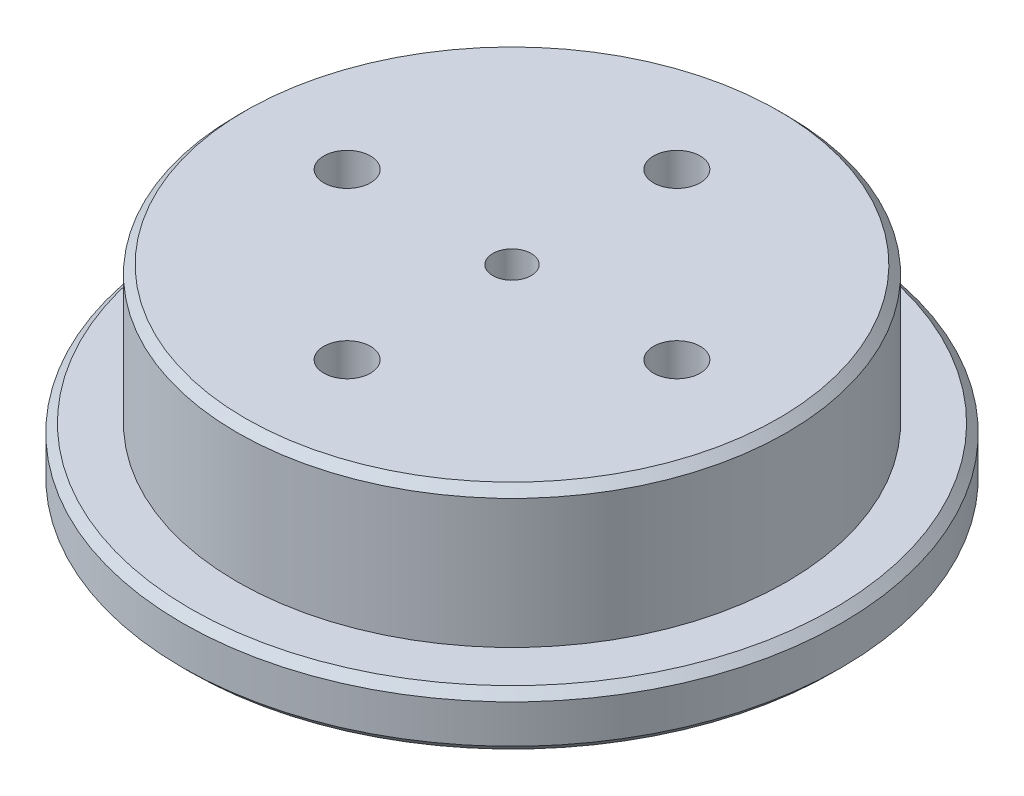
ISO-10303-21;
HEADER;
FILE_DESCRIPTION(('STEP AP214'),'2;1');
FILE_NAME('part.step','',(''),(''),'','','');
FILE_SCHEMA(('AUTOMOTIVE_DESIGN { 1 0 10303 214 1 1 1 1 }'));
ENDSEC;
DATA;
#1=APPLICATION_CONTEXT('core data for automotive mechanical design processes');
#2=APPLICATION_PROTOCOL_DEFINITION('international standard','automotive_design',2000,#1);
#3=PRODUCT_CONTEXT('',#1,'mechanical');
#4=PRODUCT('Part','Part','',(#3));
#5=PRODUCT_RELATED_PRODUCT_CATEGORY('part','',(#4));
#6=PRODUCT_DEFINITION_FORMATION('','',#4);
#7=PRODUCT_DEFINITION_CONTEXT('part definition',#1,'design');
#8=PRODUCT_DEFINITION('design','',#6,#7);
#9=PRODUCT_DEFINITION_SHAPE('','',#8);
#10=(LENGTH_UNIT() NAMED_UNIT(*) SI_UNIT(.MILLI.,.METRE.));
#11=(NAMED_UNIT(*) PLANE_ANGLE_UNIT() SI_UNIT($,.RADIAN.));
#12=(NAMED_UNIT(*) SI_UNIT($,.STERADIAN.) SOLID_ANGLE_UNIT());
#13=UNCERTAINTY_MEASURE_WITH_UNIT(LENGTH_MEASURE(1.E-05),#10,'distance_accuracy_value','');
#14=(GEOMETRIC_REPRESENTATION_CONTEXT(3) GLOBAL_UNCERTAINTY_ASSIGNED_CONTEXT((#13)) GLOBAL_UNIT_ASSIGNED_CONTEXT((#10,
#11,#12)) REPRESENTATION_CONTEXT('',''));
#15=CARTESIAN_POINT('',(0.,0.,0.));
#16=DIRECTION('',(0.,0.,1.));
#17=DIRECTION('',(1.,0.,0.));
#18=AXIS2_PLACEMENT_3D('',#15,#16,#17);
#19=CARTESIAN_POINT('',(0.,20.,0.));
#20=DIRECTION('',(0.,-1.,0.));
#21=DIRECTION('',(0.,0.,-1.));
#22=AXIS2_PLACEMENT_3D('',#19,#20,#21);
#23=CYLINDRICAL_SURFACE('',#22,120.);
#24=CARTESIAN_POINT('',(0.,2.99999999999999,0.));
#25=DIRECTION('',(0.,1.,0.));
#26=DIRECTION('',(0.,0.,1.));
#27=AXIS2_PLACEMENT_3D('',#24,#25,#26);
#28=CIRCLE('',#27,120.);
#29=CARTESIAN_POINT('',(0.,2.99999999999999,120.));
#30=VERTEX_POINT('',#29);
#31=EDGE_CURVE('E112',#30,#30,#28,.T.);
#32=ORIENTED_EDGE('',*,*,#31,.T.);
#33=EDGE_LOOP('',(#32));
#34=FACE_BOUND('',#33,.T.);
#35=CARTESIAN_POINT('',(0.,17.0000000000001,0.));
#36=DIRECTION('',(0.,1.,0.));
#37=DIRECTION('',(0.,0.,1.));
#38=AXIS2_PLACEMENT_3D('',#35,#36,#37);
#39=CIRCLE('',#38,120.);
#40=CARTESIAN_POINT('',(0.,17.0000000000001,120.));
#41=VERTEX_POINT('',#40);
#42=EDGE_CURVE('E109',#41,#41,#39,.F.);
#43=ORIENTED_EDGE('',*,*,#42,.T.);
#44=EDGE_LOOP('',(#43));
#45=FACE_BOUND('',#44,.T.);
#46=ADVANCED_FACE('F53',(#34,#45),#23,.T.);
#47=CARTESIAN_POINT('',(0.,20.,0.));
#48=DIRECTION('',(0.,1.,0.));
#49=DIRECTION('',(0.,0.,1.));
#50=AXIS2_PLACEMENT_3D('',#47,#48,#49);
#51=PLANE('',#50);
#52=CARTESIAN_POINT('',(0.,20.,0.));
#53=DIRECTION('',(0.,1.,0.));
#54=DIRECTION('',(0.,0.,1.));
#55=AXIS2_PLACEMENT_3D('',#52,#53,#54);
#56=CIRCLE('',#55,117.);
#57=CARTESIAN_POINT('',(0.,20.,117.));
#58=VERTEX_POINT('',#57);
#59=EDGE_CURVE('E118',#58,#58,#56,.T.);
#60=ORIENTED_EDGE('',*,*,#59,.T.);
#61=EDGE_LOOP('',(#60));
#62=FACE_BOUND('',#61,.T.);
#63=CARTESIAN_POINT('',(0.,20.,0.));
#64=DIRECTION('',(0.,1.,0.));
#65=DIRECTION('',(0.,0.,1.));
#66=AXIS2_PLACEMENT_3D('',#63,#64,#65);
#67=CIRCLE('',#66,100.);
#68=CARTESIAN_POINT('',(0.,20.,100.));
#69=VERTEX_POINT('',#68);
#70=EDGE_CURVE('E103',#69,#69,#67,.T.);
#71=ORIENTED_EDGE('',*,*,#70,.F.);
#72=EDGE_LOOP('',(#71));
#73=FACE_BOUND('',#72,.T.);
#74=ADVANCED_FACE('F141',(#62,#73),#51,.T.);
#75=CARTESIAN_POINT('',(0.,0.,0.));
#76=DIRECTION('',(0.,1.,0.));
#77=DIRECTION('',(0.,0.,1.));
#78=AXIS2_PLACEMENT_3D('',#75,#76,#77);
#79=PLANE('',#78);
#80=CARTESIAN_POINT('',(0.,0.,0.));
#81=DIRECTION('',(0.,1.,0.));
#82=DIRECTION('',(0.,0.,1.));
#83=AXIS2_PLACEMENT_3D('',#80,#81,#82);
#84=CIRCLE('',#83,117.);
#85=CARTESIAN_POINT('',(0.,0.,117.));
#86=VERTEX_POINT('',#85);
#87=EDGE_CURVE('E115',#86,#86,#84,.F.);
#88=ORIENTED_EDGE('',*,*,#87,.T.);
#89=EDGE_LOOP('',(#88));
#90=FACE_BOUND('',#89,.T.);
#91=CARTESIAN_POINT('',(0.,0.,0.));
#92=DIRECTION('',(0.,1.,0.));
#93=DIRECTION('',(0.,0.,1.));
#94=AXIS2_PLACEMENT_3D('',#91,#92,#93);
#95=CIRCLE('',#94,20.);
#96=CARTESIAN_POINT('',(0.,0.,20.));
#97=VERTEX_POINT('',#96);
#98=EDGE_CURVE('E106',#97,#97,#95,.F.);
#99=ORIENTED_EDGE('',*,*,#98,.F.);
#100=EDGE_LOOP('',(#99));
#101=FACE_BOUND('',#100,.T.);
#102=CARTESIAN_POINT('',(0.,0.,-60.));
#103=DIRECTION('',(0.,1.,0.));
#104=DIRECTION('',(0.,0.,1.));
#105=AXIS2_PLACEMENT_3D('',#102,#103,#104);
#106=CIRCLE('',#105,8.5);
#107=CARTESIAN_POINT('',(0.,0.,-51.5));
#108=VERTEX_POINT('',#107);
#109=EDGE_CURVE('E100',#108,#108,#106,.T.);
#110=ORIENTED_EDGE('',*,*,#109,.T.);
#111=EDGE_LOOP('',(#110));
#112=FACE_BOUND('',#111,.T.);
#113=CARTESIAN_POINT('',(60.,0.,2.09488880330588E-13));
#114=DIRECTION('',(0.,1.,0.));
#115=DIRECTION('',(0.,0.,1.));
#116=AXIS2_PLACEMENT_3D('',#113,#114,#115);
#117=CIRCLE('',#116,8.5);
#118=CARTESIAN_POINT('',(60.,0.,8.50000000000021));
#119=VERTEX_POINT('',#118);
#120=EDGE_CURVE('E97',#119,#119,#117,.T.);
#121=ORIENTED_EDGE('',*,*,#120,.T.);
#122=EDGE_LOOP('',(#121));
#123=FACE_BOUND('',#122,.T.);
#124=CARTESIAN_POINT('',(-4.18977760661176E-13,0.,60.));
#125=DIRECTION('',(0.,1.,0.));
#126=DIRECTION('',(0.,0.,1.));
#127=AXIS2_PLACEMENT_3D('',#124,#125,#126);
#128=CIRCLE('',#127,8.5);
#129=CARTESIAN_POINT('',(-4.18977760661176E-13,0.,68.5));
#130=VERTEX_POINT('',#129);
#131=EDGE_CURVE('E94',#130,#130,#128,.T.);
#132=ORIENTED_EDGE('',*,*,#131,.T.);
#133=EDGE_LOOP('',(#132));
#134=FACE_BOUND('',#133,.T.);
#135=CARTESIAN_POINT('',(-60.,0.,-6.28466640991764E-13));
#136=DIRECTION('',(0.,1.,0.));
#137=DIRECTION('',(0.,0.,1.));
#138=AXIS2_PLACEMENT_3D('',#135,#136,#137);
#139=CIRCLE('',#138,8.5);
#140=CARTESIAN_POINT('',(-60.,0.,8.49999999999937));
#141=VERTEX_POINT('',#140);
#142=EDGE_CURVE('E86',#141,#141,#139,.T.);
#143=ORIENTED_EDGE('',*,*,#142,.T.);
#144=EDGE_LOOP('',(#143));
#145=FACE_BOUND('',#144,.T.);
#146=ADVANCED_FACE('F148',(#90,#101,#112,#123,#134,#145),#79,.F.);
#147=CARTESIAN_POINT('',(0.,70.,0.));
#148=DIRECTION('',(0.,-1.,0.));
#149=DIRECTION('',(0.,0.,-1.));
#150=AXIS2_PLACEMENT_3D('',#147,#148,#149);
#151=CYLINDRICAL_SURFACE('',#150,100.);
#152=CARTESIAN_POINT('',(0.,67.,0.));
#153=DIRECTION('',(0.,1.,0.));
#154=DIRECTION('',(0.,0.,1.));
#155=AXIS2_PLACEMENT_3D('',#152,#153,#154);
#156=CIRCLE('',#155,100.);
#157=CARTESIAN_POINT('',(0.,67.,100.));
#158=VERTEX_POINT('',#157);
#159=EDGE_CURVE('E124',#158,#158,#156,.F.);
#160=ORIENTED_EDGE('',*,*,#159,.T.);
#161=EDGE_LOOP('',(#160));
#162=FACE_BOUND('',#161,.T.);
#163=ORIENTED_EDGE('',*,*,#70,.T.);
#164=EDGE_LOOP('',(#163));
#165=FACE_BOUND('',#164,.T.);
#166=ADVANCED_FACE('F179',(#162,#165),#151,.T.);
#167=CARTESIAN_POINT('',(0.,70.,0.));
#168=DIRECTION('',(0.,1.,0.));
#169=DIRECTION('',(0.,0.,1.));
#170=AXIS2_PLACEMENT_3D('',#167,#168,#169);
#171=PLANE('',#170);
#172=CARTESIAN_POINT('',(0.,70.,0.));
#173=DIRECTION('',(0.,1.,0.));
#174=DIRECTION('',(0.,0.,1.));
#175=AXIS2_PLACEMENT_3D('',#172,#173,#174);
#176=CIRCLE('',#175,97.);
#177=CARTESIAN_POINT('',(0.,70.,97.));
#178=VERTEX_POINT('',#177);
#179=EDGE_CURVE('E121',#178,#178,#176,.T.);
#180=ORIENTED_EDGE('',*,*,#179,.T.);
#181=EDGE_LOOP('',(#180));
#182=FACE_BOUND('',#181,.T.);
#183=CARTESIAN_POINT('',(0.,70.,0.));
#184=DIRECTION('',(0.,1.,0.));
#185=DIRECTION('',(0.,0.,1.));
#186=AXIS2_PLACEMENT_3D('',#183,#184,#185);
#187=CIRCLE('',#186,6.99999999999999);
#188=CARTESIAN_POINT('',(0.,70.,6.99999999999999));
#189=VERTEX_POINT('',#188);
#190=EDGE_CURVE('E75',#189,#189,#187,.T.);
#191=ORIENTED_EDGE('',*,*,#190,.F.);
#192=EDGE_LOOP('',(#191));
#193=FACE_BOUND('',#192,.T.);
#194=CARTESIAN_POINT('',(0.,70.,-60.));
#195=DIRECTION('',(0.,1.,0.));
#196=DIRECTION('',(0.,0.,1.));
#197=AXIS2_PLACEMENT_3D('',#194,#195,#196);
#198=CIRCLE('',#197,8.5);
#199=CARTESIAN_POINT('',(0.,70.,-51.5));
#200=VERTEX_POINT('',#199);
#201=EDGE_CURVE('E83',#200,#200,#198,.T.);
#202=ORIENTED_EDGE('',*,*,#201,.F.);
#203=EDGE_LOOP('',(#202));
#204=FACE_BOUND('',#203,.T.);
#205=CARTESIAN_POINT('',(60.,70.,2.09488880330588E-13));
#206=DIRECTION('',(0.,1.,0.));
#207=DIRECTION('',(0.,0.,1.));
#208=AXIS2_PLACEMENT_3D('',#205,#206,#207);
#209=CIRCLE('',#208,8.5);
#210=CARTESIAN_POINT('',(60.,70.,8.50000000000021));
#211=VERTEX_POINT('',#210);
#212=EDGE_CURVE('E87',#211,#211,#209,.T.);
#213=ORIENTED_EDGE('',*,*,#212,.F.);
#214=EDGE_LOOP('',(#213));
#215=FACE_BOUND('',#214,.T.);
#216=CARTESIAN_POINT('',(-4.18977760661176E-13,70.,60.));
#217=DIRECTION('',(0.,1.,0.));
#218=DIRECTION('',(0.,0.,1.));
#219=AXIS2_PLACEMENT_3D('',#216,#217,#218);
#220=CIRCLE('',#219,8.5);
#221=CARTESIAN_POINT('',(-4.18977760661176E-13,70.,68.5));
#222=VERTEX_POINT('',#221);
#223=EDGE_CURVE('E78',#222,#222,#220,.T.);
#224=ORIENTED_EDGE('',*,*,#223,.F.);
#225=EDGE_LOOP('',(#224));
#226=FACE_BOUND('',#225,.T.);
#227=CARTESIAN_POINT('',(-60.,70.,-6.28466640991764E-13));
#228=DIRECTION('',(0.,1.,0.));
#229=DIRECTION('',(0.,0.,1.));
#230=AXIS2_PLACEMENT_3D('',#227,#228,#229);
#231=CIRCLE('',#230,8.5);
#232=CARTESIAN_POINT('',(-60.,70.,8.49999999999937));
#233=VERTEX_POINT('',#232);
#234=EDGE_CURVE('E74',#233,#233,#231,.T.);
#235=ORIENTED_EDGE('',*,*,#234,.F.);
#236=EDGE_LOOP('',(#235));
#237=FACE_BOUND('',#236,.T.);
#238=ADVANCED_FACE('F181',(#182,#193,#204,#215,#226,#237),#171,.T.);
#239=CARTESIAN_POINT('',(-60.,-9.99999999999999,-6.28466640991764E-13));
#240=DIRECTION('',(0.,1.,0.));
#241=DIRECTION('',(0.,0.,1.));
#242=AXIS2_PLACEMENT_3D('',#239,#240,#241);
#243=CYLINDRICAL_SURFACE('',#242,8.5);
#244=ORIENTED_EDGE('',*,*,#234,.T.);
#245=EDGE_LOOP('',(#244));
#246=FACE_BOUND('',#245,.T.);
#247=ORIENTED_EDGE('',*,*,#142,.F.);
#248=EDGE_LOOP('',(#247));
#249=FACE_BOUND('',#248,.T.);
#250=ADVANCED_FACE('F188',(#246,#249),#243,.F.);
#251=CARTESIAN_POINT('',(-4.18977760661176E-13,-9.99999999999999,60.));
#252=DIRECTION('',(0.,1.,0.));
#253=DIRECTION('',(0.,0.,1.));
#254=AXIS2_PLACEMENT_3D('',#251,#252,#253);
#255=CYLINDRICAL_SURFACE('',#254,8.5);
#256=ORIENTED_EDGE('',*,*,#223,.T.);
#257=EDGE_LOOP('',(#256));
#258=FACE_BOUND('',#257,.T.);
#259=ORIENTED_EDGE('',*,*,#131,.F.);
#260=EDGE_LOOP('',(#259));
#261=FACE_BOUND('',#260,.T.);
#262=ADVANCED_FACE('F195',(#258,#261),#255,.F.);
#263=CARTESIAN_POINT('',(60.,-9.99999999999999,2.09488880330588E-13));
#264=DIRECTION('',(0.,1.,0.));
#265=DIRECTION('',(0.,0.,1.));
#266=AXIS2_PLACEMENT_3D('',#263,#264,#265);
#267=CYLINDRICAL_SURFACE('',#266,8.5);
#268=ORIENTED_EDGE('',*,*,#212,.T.);
#269=EDGE_LOOP('',(#268));
#270=FACE_BOUND('',#269,.T.);
#271=ORIENTED_EDGE('',*,*,#120,.F.);
#272=EDGE_LOOP('',(#271));
#273=FACE_BOUND('',#272,.T.);
#274=ADVANCED_FACE('F199',(#270,#273),#267,.F.);
#275=CARTESIAN_POINT('',(0.,-9.99999999999999,-60.));
#276=DIRECTION('',(0.,1.,0.));
#277=DIRECTION('',(0.,0.,1.));
#278=AXIS2_PLACEMENT_3D('',#275,#276,#277);
#279=CYLINDRICAL_SURFACE('',#278,8.5);
#280=ORIENTED_EDGE('',*,*,#201,.T.);
#281=EDGE_LOOP('',(#280));
#282=FACE_BOUND('',#281,.T.);
#283=ORIENTED_EDGE('',*,*,#109,.F.);
#284=EDGE_LOOP('',(#283));
#285=FACE_BOUND('',#284,.T.);
#286=ADVANCED_FACE('F203',(#282,#285),#279,.F.);
#287=CARTESIAN_POINT('',(0.,-20.,0.));
#288=DIRECTION('',(0.,1.,0.));
#289=DIRECTION('',(0.,0.,1.));
#290=AXIS2_PLACEMENT_3D('',#287,#288,#289);
#291=CYLINDRICAL_SURFACE('',#290,20.);
#292=CARTESIAN_POINT('',(0.,-16.9999999999999,0.));
#293=DIRECTION('',(0.,-1.,0.));
#294=DIRECTION('',(0.,0.,-1.));
#295=AXIS2_PLACEMENT_3D('',#292,#293,#294);
#296=CIRCLE('',#295,20.);
#297=CARTESIAN_POINT('',(0.,-16.9999999999999,-20.));
#298=VERTEX_POINT('',#297);
#299=EDGE_CURVE('E11',#298,#298,#296,.F.);
#300=ORIENTED_EDGE('',*,*,#299,.T.);
#301=EDGE_LOOP('',(#300));
#302=FACE_BOUND('',#301,.T.);
#303=ORIENTED_EDGE('',*,*,#98,.T.);
#304=EDGE_LOOP('',(#303));
#305=FACE_BOUND('',#304,.T.);
#306=ADVANCED_FACE('F207',(#302,#305),#291,.T.);
#307=CARTESIAN_POINT('',(0.,-20.,0.));
#308=DIRECTION('',(0.,-1.,0.));
#309=DIRECTION('',(0.,0.,-1.));
#310=AXIS2_PLACEMENT_3D('',#307,#308,#309);
#311=PLANE('',#310);
#312=CARTESIAN_POINT('',(0.,-20.,0.));
#313=DIRECTION('',(0.,-1.,0.));
#314=DIRECTION('',(0.,0.,-1.));
#315=AXIS2_PLACEMENT_3D('',#312,#313,#314);
#316=CIRCLE('',#315,17.);
#317=CARTESIAN_POINT('',(0.,-20.,-17.));
#318=VERTEX_POINT('',#317);
#319=EDGE_CURVE('E61',#318,#318,#316,.T.);
#320=ORIENTED_EDGE('',*,*,#319,.T.);
#321=EDGE_LOOP('',(#320));
#322=FACE_BOUND('',#321,.T.);
#323=ADVANCED_FACE('F68',(#322),#311,.T.);
#324=CARTESIAN_POINT('',(0.,50.,0.));
#325=DIRECTION('',(0.,1.,0.));
#326=DIRECTION('',(0.,0.,1.));
#327=AXIS2_PLACEMENT_3D('',#324,#325,#326);
#328=CONICAL_SURFACE('',#327,6.99999999999999,1.02974425867665);
#329=CARTESIAN_POINT('',(0.,45.7939756668071,0.));
#330=VERTEX_POINT('',#329);
#331=VERTEX_LOOP('',#330);
#332=FACE_BOUND('',#331,.T.);
#333=CARTESIAN_POINT('',(0.,50.,0.));
#334=DIRECTION('',(0.,1.,0.));
#335=DIRECTION('',(0.,0.,1.));
#336=AXIS2_PLACEMENT_3D('',#333,#334,#335);
#337=CIRCLE('',#336,6.99999999999999);
#338=CARTESIAN_POINT('',(0.,50.,6.99999999999999));
#339=VERTEX_POINT('',#338);
#340=EDGE_CURVE('E72',#339,#339,#337,.T.);
#341=ORIENTED_EDGE('',*,*,#340,.T.);
#342=EDGE_LOOP('',(#341));
#343=FACE_BOUND('',#342,.T.);
#344=ADVANCED_FACE('F64',(#332,#343),#328,.F.);
#345=CARTESIAN_POINT('',(0.,70.,0.));
#346=DIRECTION('',(0.,1.,0.));
#347=DIRECTION('',(0.,0.,1.));
#348=AXIS2_PLACEMENT_3D('',#345,#346,#347);
#349=CYLINDRICAL_SURFACE('',#348,6.99999999999999);
#350=ORIENTED_EDGE('',*,*,#340,.F.);
#351=EDGE_LOOP('',(#350));
#352=FACE_BOUND('',#351,.T.);
#353=ORIENTED_EDGE('',*,*,#190,.T.);
#354=EDGE_LOOP('',(#353));
#355=FACE_BOUND('',#354,.T.);
#356=ADVANCED_FACE('F67',(#352,#355),#349,.F.);
#357=CARTESIAN_POINT('',(0.,2.99999999999999,0.));
#358=DIRECTION('',(0.,1.,0.));
#359=DIRECTION('',(0.,0.,1.));
#360=AXIS2_PLACEMENT_3D('',#357,#358,#359);
#361=CONICAL_SURFACE('',#360,120.,0.785398163397448);
#362=ORIENTED_EDGE('',*,*,#87,.F.);
#363=EDGE_LOOP('',(#362));
#364=FACE_BOUND('',#363,.T.);
#365=ORIENTED_EDGE('',*,*,#31,.F.);
#366=EDGE_LOOP('',(#365));
#367=FACE_BOUND('',#366,.T.);
#368=ADVANCED_FACE('F155',(#364,#367),#361,.T.);
#369=CARTESIAN_POINT('',(0.,20.,0.));
#370=DIRECTION('',(0.,-1.,0.));
#371=DIRECTION('',(0.,0.,-1.));
#372=AXIS2_PLACEMENT_3D('',#369,#370,#371);
#373=CONICAL_SURFACE('',#372,117.,0.785398163397448);
#374=ORIENTED_EDGE('',*,*,#42,.F.);
#375=EDGE_LOOP('',(#374));
#376=FACE_BOUND('',#375,.T.);
#377=ORIENTED_EDGE('',*,*,#59,.F.);
#378=EDGE_LOOP('',(#377));
#379=FACE_BOUND('',#378,.T.);
#380=ADVANCED_FACE('F137',(#376,#379),#373,.T.);
#381=CARTESIAN_POINT('',(0.,70.,0.));
#382=DIRECTION('',(0.,-1.,0.));
#383=DIRECTION('',(0.,0.,-1.));
#384=AXIS2_PLACEMENT_3D('',#381,#382,#383);
#385=CONICAL_SURFACE('',#384,97.,0.785398163397437);
#386=ORIENTED_EDGE('',*,*,#159,.F.);
#387=EDGE_LOOP('',(#386));
#388=FACE_BOUND('',#387,.T.);
#389=ORIENTED_EDGE('',*,*,#179,.F.);
#390=EDGE_LOOP('',(#389));
#391=FACE_BOUND('',#390,.T.);
#392=ADVANCED_FACE('F131',(#388,#391),#385,.T.);
#393=CARTESIAN_POINT('',(0.,-20.,0.));
#394=DIRECTION('',(0.,1.,0.));
#395=DIRECTION('',(0.,0.,1.));
#396=AXIS2_PLACEMENT_3D('',#393,#394,#395);
#397=CONICAL_SURFACE('',#396,17.,0.785398163397446);
#398=ORIENTED_EDGE('',*,*,#299,.F.);
#399=EDGE_LOOP('',(#398));
#400=FACE_BOUND('',#399,.T.);
#401=ORIENTED_EDGE('',*,*,#319,.F.);
#402=EDGE_LOOP('',(#401));
#403=FACE_BOUND('',#402,.T.);
#404=ADVANCED_FACE('F56',(#400,#403),#397,.T.);
#405=CLOSED_SHELL('',(#46,#74,#146,#166,#238,#250,#262,#274,#286,#306,#323,#344,#356,#368,#380,
#392,#404));
#406=MANIFOLD_SOLID_BREP('B2',#405);
#407=ADVANCED_BREP_SHAPE_REPRESENTATION('',(#18,#406),#14);
#408=SHAPE_DEFINITION_REPRESENTATION(#9,#407);
ENDSEC;
END-ISO-10303-21;
